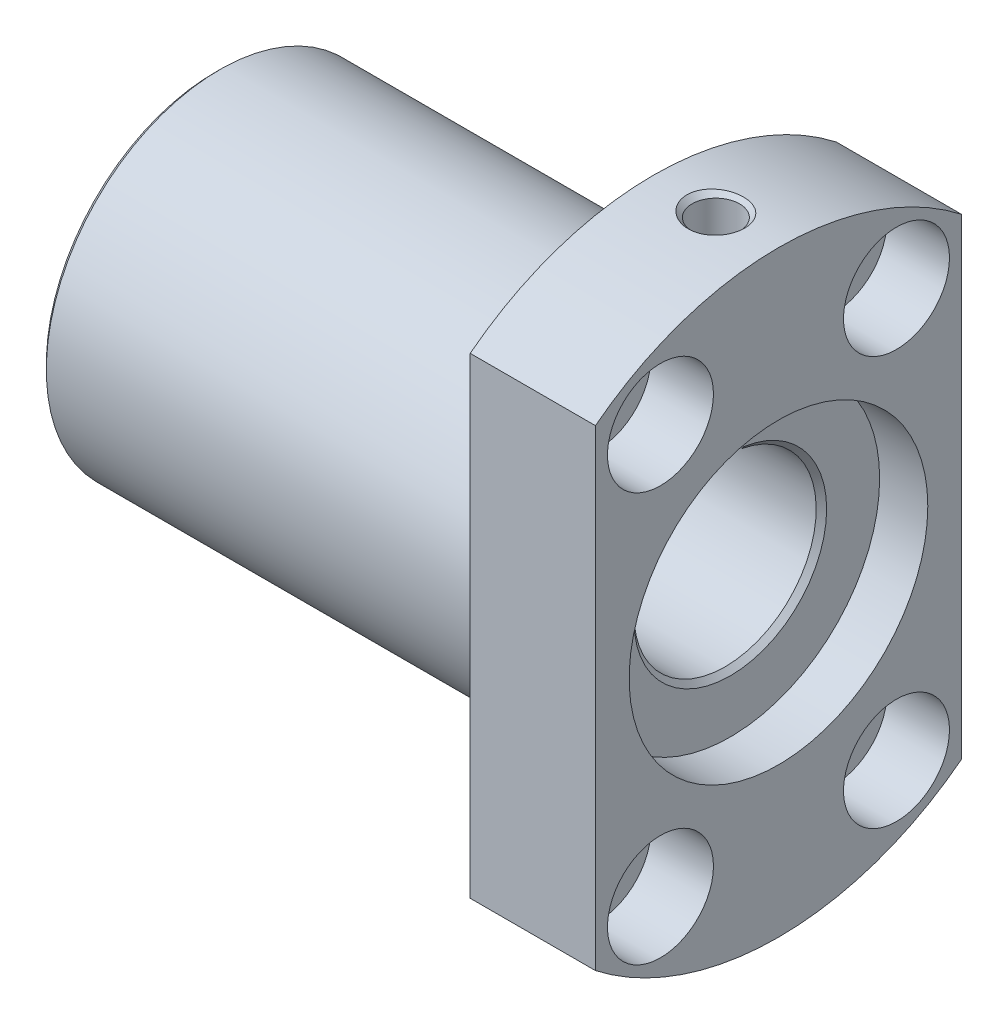
ISO-10303-21;
HEADER;
FILE_DESCRIPTION(('STEP AP214'),'2;1');
FILE_NAME('part.step','',(''),(''),'','','');
FILE_SCHEMA(('AUTOMOTIVE_DESIGN { 1 0 10303 214 1 1 1 1 }'));
ENDSEC;
DATA;
#1=APPLICATION_CONTEXT('core data for automotive mechanical design processes');
#2=APPLICATION_PROTOCOL_DEFINITION('international standard','automotive_design',2000,#1);
#3=PRODUCT_CONTEXT('',#1,'mechanical');
#4=PRODUCT('Part','Part','',(#3));
#5=PRODUCT_RELATED_PRODUCT_CATEGORY('part','',(#4));
#6=PRODUCT_DEFINITION_FORMATION('','',#4);
#7=PRODUCT_DEFINITION_CONTEXT('part definition',#1,'design');
#8=PRODUCT_DEFINITION('design','',#6,#7);
#9=PRODUCT_DEFINITION_SHAPE('','',#8);
#10=(LENGTH_UNIT() NAMED_UNIT(*) SI_UNIT(.MILLI.,.METRE.));
#11=(NAMED_UNIT(*) PLANE_ANGLE_UNIT() SI_UNIT($,.RADIAN.));
#12=(NAMED_UNIT(*) SI_UNIT($,.STERADIAN.) SOLID_ANGLE_UNIT());
#13=UNCERTAINTY_MEASURE_WITH_UNIT(LENGTH_MEASURE(1.E-05),#10,'distance_accuracy_value','');
#14=(GEOMETRIC_REPRESENTATION_CONTEXT(3) GLOBAL_UNCERTAINTY_ASSIGNED_CONTEXT((#13)) GLOBAL_UNIT_ASSIGNED_CONTEXT((#10,
#11,#12)) REPRESENTATION_CONTEXT('',''));
#15=CARTESIAN_POINT('',(0.,0.,0.));
#16=DIRECTION('',(0.,0.,1.));
#17=DIRECTION('',(1.,0.,0.));
#18=AXIS2_PLACEMENT_3D('',#15,#16,#17);
#19=CARTESIAN_POINT('',(827.75,0.,0.));
#20=DIRECTION('',(1.,0.,0.));
#21=DIRECTION('',(0.,0.,-1.));
#22=AXIS2_PLACEMENT_3D('',#19,#20,#21);
#23=CONICAL_SURFACE('',#22,9.99999999999999,0.785398163397458);
#24=CARTESIAN_POINT('',(827.75,0.,0.));
#25=DIRECTION('',(1.,0.,0.));
#26=DIRECTION('',(0.,0.,-1.));
#27=AXIS2_PLACEMENT_3D('',#24,#25,#26);
#28=CIRCLE('',#27,10.);
#29=CARTESIAN_POINT('',(827.75,9.9121138007995,1.32287565553231));
#30=VERTEX_POINT('',#29);
#31=CARTESIAN_POINT('',(827.75,9.9121138007995,-1.32287565553233));
#32=VERTEX_POINT('',#31);
#33=EDGE_CURVE('E83',#30,#32,#28,.T.);
#34=ORIENTED_EDGE('',*,*,#33,.T.);
#35=CARTESIAN_POINT('',(827.75,9.91211380079951,-1.32287565553234));
#36=CARTESIAN_POINT('',(827.709124962366,9.86468983407072,-1.36919680959697));
#37=CARTESIAN_POINT('',(827.666890498792,9.81585567181097,-1.41278724147606));
#38=CARTESIAN_POINT('',(827.580338384388,9.71617737689539,-1.49457124787764));
#39=CARTESIAN_POINT('',(827.536032508283,9.66534481709641,-1.53279131486725));
#40=CARTESIAN_POINT('',(827.445555766791,9.56199410662673,-1.60436020141633));
#41=CARTESIAN_POINT('',(827.399385300994,9.5094763175985,-1.63771005768593));
#42=CARTESIAN_POINT('',(827.305204528102,9.40286057552503,-1.69992138470777));
#43=CARTESIAN_POINT('',(827.25718597894,9.34875588405938,-1.72875888606244));
#44=CARTESIAN_POINT('',(827.208499999957,9.29418874884218,-1.75535687257106));
#45=B_SPLINE_CURVE_WITH_KNOTS('',3,(#35,#36,#37,#38,#39,#40,#41,#42,#43,#44),.UNSPECIFIED.,.F.,
.F.,(4,2,2,2,4),(0.,0.233495743528674,0.46579583534785,0.698046405694527,0.931491609557884),.UNSPECIFIED.);
#46=CARTESIAN_POINT('',(827.208499999952,9.29418874886478,-1.75535687257395));
#47=VERTEX_POINT('',#46);
#48=EDGE_CURVE('E21',#32,#47,#45,.T.);
#49=ORIENTED_EDGE('',*,*,#48,.T.);
#50=CARTESIAN_POINT('',(827.2085,0.,0.));
#51=DIRECTION('',(1.,0.,0.));
#52=DIRECTION('',(0.,0.,-1.));
#53=AXIS2_PLACEMENT_3D('',#50,#51,#52);
#54=CIRCLE('',#53,9.4585);
#55=CARTESIAN_POINT('',(827.2085,9.29418874889036,1.75535687254759));
#56=VERTEX_POINT('',#55);
#57=EDGE_CURVE('E81',#47,#56,#54,.F.);
#58=ORIENTED_EDGE('',*,*,#57,.T.);
#59=CARTESIAN_POINT('',(827.2085,9.29418874889036,1.75535687254759));
#60=CARTESIAN_POINT('',(827.257185978979,9.34875588410325,1.72875888603959));
#61=CARTESIAN_POINT('',(827.305204528137,9.40286057556457,1.69992138468589));
#62=CARTESIAN_POINT('',(827.399385301021,9.50947631762956,1.63771005766661));
#63=CARTESIAN_POINT('',(827.445555766815,9.56199410665364,1.60436020139859));
#64=CARTESIAN_POINT('',(827.5360325083,9.66534481711521,1.53279131485334));
#65=CARTESIAN_POINT('',(827.580338384401,9.71617737691023,1.49457124786597));
#66=CARTESIAN_POINT('',(827.666890498798,9.81585567181816,1.41278724146965));
#67=CARTESIAN_POINT('',(827.709124962369,9.86468983407423,1.36919680959355));
#68=CARTESIAN_POINT('',(827.75,9.9121138007995,1.32287565553236));
#69=B_SPLINE_CURVE_WITH_KNOTS('',3,(#59,#60,#61,#62,#63,#64,#65,#66,#67,#68),.UNSPECIFIED.,.F.,
.F.,(4,2,2,2,4),(0.,0.233445203845981,0.465695774175681,0.697995865977701,0.931491609489217),.UNSPECIFIED.);
#70=EDGE_CURVE('E87',#56,#30,#69,.T.);
#71=ORIENTED_EDGE('',*,*,#70,.T.);
#72=EDGE_LOOP('',(#34,#49,#58,#71));
#73=FACE_BOUND('',#72,.T.);
#74=ADVANCED_FACE('F17',(#73),#23,.F.);
#75=CARTESIAN_POINT('',(826.25,14.8676424507883,0.));
#76=DIRECTION('',(0.,-1.,0.));
#77=DIRECTION('',(0.,0.,-1.));
#78=AXIS2_PLACEMENT_3D('',#75,#76,#77);
#79=CYLINDRICAL_SURFACE('',#78,2.);
#80=ORIENTED_EDGE('',*,*,#70,.F.);
#81=CARTESIAN_POINT('',(827.2085,9.29418874889035,1.75535687254759));
#82=CARTESIAN_POINT('',(827.159992328888,9.28918498913295,1.78184326444738));
#83=CARTESIAN_POINT('',(827.110387287465,9.28444678824169,1.80631868300601));
#84=CARTESIAN_POINT('',(827.009270593768,9.27562273369679,1.85109957967904));
#85=CARTESIAN_POINT('',(826.957758833406,9.27153691709546,1.87140482096599));
#86=CARTESIAN_POINT('',(826.800939625697,9.26045030079549,1.92579211084513));
#87=CARTESIAN_POINT('',(826.693221163041,9.25460675432746,1.95341505251219));
#88=CARTESIAN_POINT('',(826.474500956478,9.24671054458624,1.99045959220235));
#89=CARTESIAN_POINT('',(826.363496064051,9.24466164452858,1.9998631221502));
#90=CARTESIAN_POINT('',(826.141495859705,9.24460318427891,2.0001337640354));
#91=CARTESIAN_POINT('',(826.030500564468,9.24659187455734,1.99100890451493));
#92=CARTESIAN_POINT('',(825.812666064328,9.25433562553321,1.95469392268662));
#93=CARTESIAN_POINT('',(825.7057987918,9.26005723337002,1.92766422350042));
#94=CARTESIAN_POINT('',(825.498101953221,9.27457959260886,1.85653010598874));
#95=CARTESIAN_POINT('',(825.39727433481,9.28338133108407,1.81242021358079));
#96=CARTESIAN_POINT('',(825.203218030092,9.30320029837076,1.70778893418694));
#97=CARTESIAN_POINT('',(825.110093176783,9.31424246983495,1.64707983881338));
#98=CARTESIAN_POINT('',(824.935240192546,9.33725283979065,1.5111810326327));
#99=CARTESIAN_POINT('',(824.853511317657,9.34922097775318,1.4359922678613));
#100=CARTESIAN_POINT('',(824.70216841002,9.37300935176981,1.27158642459021));
#101=CARTESIAN_POINT('',(824.632809126093,9.3848226517714,1.1821335892906));
#102=CARTESIAN_POINT('',(824.510036207782,9.40675462200363,0.992610659088456));
#103=CARTESIAN_POINT('',(824.456631487829,9.41687234346834,0.892534670783486));
#104=CARTESIAN_POINT('',(824.367504491443,9.4342513714551,0.68481237828306));
#105=CARTESIAN_POINT('',(824.331747387876,9.44151829808578,0.57718146717131));
#106=CARTESIAN_POINT('',(824.278975003244,9.45237937903712,0.357441412538));
#107=CARTESIAN_POINT('',(824.261911118465,9.4559830563006,0.245344671692147));
#108=CARTESIAN_POINT('',(824.25146663784,9.45819059484981,0.0885584695671524));
#109=CARTESIAN_POINT('',(824.249995863978,9.45850190858689,0.0442917313056402));
#110=CARTESIAN_POINT('',(824.250010352046,9.45849522299902,-0.110857747675023));
#111=CARTESIAN_POINT('',(824.259260285027,9.4565282630573,-0.221872064410015));
#112=CARTESIAN_POINT('',(824.296028759364,9.44885810202458,-0.440891612091419));
#113=CARTESIAN_POINT('',(824.323592387904,9.44314568029659,-0.548888729373908));
#114=CARTESIAN_POINT('',(824.396089489968,9.42862408527731,-0.758473102897842));
#115=CARTESIAN_POINT('',(824.440993997704,9.41982007830753,-0.86007072127953));
#116=CARTESIAN_POINT('',(824.546824544483,9.40007119614985,-1.05423892035544));
#117=CARTESIAN_POINT('',(824.607743389705,9.38912728279619,-1.14681352875668));
#118=CARTESIAN_POINT('',(824.744864064003,9.36611114052238,-1.32177359433504));
#119=CARTESIAN_POINT('',(824.821263129582,9.35402555075587,-1.40400274483709));
#120=CARTESIAN_POINT('',(824.986758619184,9.33018264540994,-1.55458696914434));
#121=CARTESIAN_POINT('',(825.075857304675,9.31842538874491,-1.62293956663353));
#122=CARTESIAN_POINT('',(825.265347309249,9.2964419469062,-1.74449324643459));
#123=CARTESIAN_POINT('',(825.365845154586,9.28623271624459,-1.79753160360126));
#124=CARTESIAN_POINT('',(825.574569472832,9.26869103879723,-1.88590340566774));
#125=CARTESIAN_POINT('',(825.682794375086,9.26135800933205,-1.92124043701897));
#126=CARTESIAN_POINT('',(825.902217808406,9.25053246356819,-1.97270358750146));
#127=CARTESIAN_POINT('',(826.013348936435,9.24698489724912,-1.98910536876383));
#128=CARTESIAN_POINT('',(826.236891391325,9.24396610348118,-2.0030895292276));
#129=CARTESIAN_POINT('',(826.349303105243,9.24449614298521,-2.00066605923282));
#130=CARTESIAN_POINT('',(826.570205531367,9.24952650895627,-1.9772750388254));
#131=CARTESIAN_POINT('',(826.678730273588,9.25396221606214,-1.9566092932909));
#132=CARTESIAN_POINT('',(826.890609851949,9.26619915564349,-1.897805293714));
#133=CARTESIAN_POINT('',(826.993973775535,9.27399422146897,-1.85969904664347));
#134=CARTESIAN_POINT('',(827.112815303815,9.28478799566163,-1.80444369409933));
#135=CARTESIAN_POINT('',(827.132191571924,9.28660947189719,-1.79504964931485));
#136=CARTESIAN_POINT('',(827.170599191947,9.29033708913667,-1.77565692882349));
#137=CARTESIAN_POINT('',(827.189630957738,9.29224311753428,-1.76565905123981));
#138=CARTESIAN_POINT('',(827.208499999945,9.29418874888465,-1.75535687257775));
#139=B_SPLINE_CURVE_WITH_KNOTS('',3,(#81,#82,#83,#84,#85,#86,#87,#88,#89,#90,#91,#92,#93,#94,
#95,#96,#97,#98,#99,#100,#101,#102,#103,#104,#105,#106,#107,#108,#109,#110,#111,#112,#113,#114,
#115,#116,#117,#118,#119,#120,#121,#122,#123,#124,#125,#126,#127,#128,#129,#130,#131,#132,#133,
#134,#135,#136,#137,#138),.UNSPECIFIED.,.F.,.F.,(4,2,2,2,2,2,2,2,2,2,2,2,2,2,2,2,2,2,2,2,2,2,2,
2,2,2,2,2,4),(0.,0.166383441527193,0.332776329481697,0.665131371627318,0.997815839803331,
1.33035618313174,1.65995663025326,1.98966279956168,2.32326367638294,2.6568427646306,
2.99665145857508,3.33664966315656,3.67597417963846,4.01441431844714,4.14723907274859,
4.4796860704904,4.81295458000808,5.14566879708279,5.47823380980726,5.81533770803265,
6.15250171076776,6.49312654951266,6.83368234658985,7.16921514830953,7.50485220763734,
7.83503834355972,8.16462093365908,8.2294472225115,8.29418962603755),.UNSPECIFIED.);
#140=EDGE_CURVE('E88',#56,#47,#139,.T.);
#141=ORIENTED_EDGE('',*,*,#140,.T.);
#142=ORIENTED_EDGE('',*,*,#48,.F.);
#143=DIRECTION('',(0.,1.,0.));
#144=VECTOR('',#143,1.);
#145=CARTESIAN_POINT('',(827.75,12.75,-1.3228756555323));
#146=LINE('',#145,#144);
#147=CARTESIAN_POINT('',(827.75,15.4434452114805,-1.32287565553231));
#148=VERTEX_POINT('',#147);
#149=EDGE_CURVE('E266',#32,#148,#146,.T.);
#150=ORIENTED_EDGE('',*,*,#149,.T.);
#151=CARTESIAN_POINT('',(827.75,15.4434452114805,1.32287565553232));
#152=CARTESIAN_POINT('',(827.787065384823,15.4470456020406,1.28084560866982));
#153=CARTESIAN_POINT('',(827.822348500751,15.4506044273659,1.23727676683473));
#154=CARTESIAN_POINT('',(827.889143838584,15.4575447091983,1.14732319011858));
#155=CARTESIAN_POINT('',(827.920655934768,15.4609261597898,1.10093836143343));
#156=CARTESIAN_POINT('',(828.009302617837,15.470671518659,0.957827656498796));
#157=CARTESIAN_POINT('',(828.060445993556,15.4766261626144,0.857260901324683));
#158=CARTESIAN_POINT('',(828.145163044704,15.4867641286148,0.648880430520528));
#159=CARTESIAN_POINT('',(828.178722082729,15.4909459744114,0.541060761446516));
#160=CARTESIAN_POINT('',(828.22716730625,15.4970512512113,0.32151008443251));
#161=CARTESIAN_POINT('',(828.242115869225,15.4989822251587,0.20979343974359));
#162=CARTESIAN_POINT('',(828.249205159615,15.4998978102764,0.0652144291749919));
#163=CARTESIAN_POINT('',(828.250002538829,15.5000007617038,0.0326148293424821));
#164=CARTESIAN_POINT('',(828.249991307074,15.4999973919339,-0.111672849610573));
#165=CARTESIAN_POINT('',(828.240604608948,15.4987788814499,-0.223524245542025));
#166=CARTESIAN_POINT('',(828.203257312783,15.4940274929558,-0.444273174723321));
#167=CARTESIAN_POINT('',(828.175242513109,15.4904878616658,-0.553161120066875));
#168=CARTESIAN_POINT('',(828.101458604483,15.4814909470684,-0.764613015372334));
#169=CARTESIAN_POINT('',(828.055696993122,15.4760344736711,-0.867179614768503));
#170=CARTESIAN_POINT('',(827.947815443916,15.463820071736,-1.06295011742754));
#171=CARTESIAN_POINT('',(827.885737907025,15.4570655286088,-1.15617743615474));
#172=CARTESIAN_POINT('',(827.79497598373,15.4478638717063,-1.27053292251512));
#173=CARTESIAN_POINT('',(827.77281970098,15.4456618376756,-1.29700854591425));
#174=CARTESIAN_POINT('',(827.75,15.4434452114805,-1.32287565553234));
#175=B_SPLINE_CURVE_WITH_KNOTS('',3,(#151,#152,#153,#154,#155,#156,#157,#158,#159,#160,#161,
#162,#163,#164,#165,#166,#167,#168,#169,#170,#171,#172,#173,#174),.UNSPECIFIED.,.F.,.F.,(4,2,2,
2,2,2,2,2,2,2,2,4),(0.,0.168359521237021,0.336724653823295,0.673911258593361,1.01137809721356,
1.34771076252253,1.44553025095052,1.78046320140361,2.1163749858965,2.45214501025787,
2.78705093599518,2.89078042824445),.UNSPECIFIED.);
#176=CARTESIAN_POINT('',(827.75,15.4434452114805,1.3228756555323));
#177=VERTEX_POINT('',#176);
#178=EDGE_CURVE('E93',#177,#148,#175,.T.);
#179=ORIENTED_EDGE('',*,*,#178,.F.);
#180=DIRECTION('',(0.,1.,0.));
#181=VECTOR('',#180,1.);
#182=CARTESIAN_POINT('',(827.75,12.75,1.32287565553228));
#183=LINE('',#182,#181);
#184=EDGE_CURVE('E372',#177,#30,#183,.F.);
#185=ORIENTED_EDGE('',*,*,#184,.T.);
#186=EDGE_LOOP('',(#80,#141,#142,#150,#179,#185));
#187=FACE_BOUND('',#186,.T.);
#188=CARTESIAN_POINT('',(826.25,22.2352849015692,0.));
#189=DIRECTION('',(0.,1.,0.));
#190=DIRECTION('',(1.,0.,0.));
#191=AXIS2_PLACEMENT_3D('',#188,#189,#190);
#192=CIRCLE('',#191,2.00000000002543);
#193=CARTESIAN_POINT('',(828.250000000025,22.2352849015692,0.));
#194=VERTEX_POINT('',#193);
#195=EDGE_CURVE('E96',#194,#194,#192,.T.);
#196=ORIENTED_EDGE('',*,*,#195,.T.);
#197=EDGE_LOOP('',(#196));
#198=FACE_BOUND('',#197,.T.);
#199=ADVANCED_FACE('F89',(#187,#198),#79,.F.);
#200=CARTESIAN_POINT('',(803.5,0.,0.));
#201=DIRECTION('',(1.,0.,0.));
#202=DIRECTION('',(0.,0.,-1.));
#203=AXIS2_PLACEMENT_3D('',#200,#201,#202);
#204=CYLINDRICAL_SURFACE('',#203,9.4585);
#205=CARTESIAN_POINT('',(779.7915,0.,0.));
#206=DIRECTION('',(-1.,0.,0.));
#207=DIRECTION('',(0.,1.,0.));
#208=AXIS2_PLACEMENT_3D('',#205,#206,#207);
#209=CIRCLE('',#208,9.45849999999997);
#210=CARTESIAN_POINT('',(779.7915,9.45849999999997,0.));
#211=VERTEX_POINT('',#210);
#212=EDGE_CURVE('E102',#211,#211,#209,.T.);
#213=ORIENTED_EDGE('',*,*,#212,.T.);
#214=EDGE_LOOP('',(#213));
#215=FACE_BOUND('',#214,.T.);
#216=ORIENTED_EDGE('',*,*,#140,.F.);
#217=ORIENTED_EDGE('',*,*,#57,.F.);
#218=EDGE_LOOP('',(#216,#217));
#219=FACE_BOUND('',#218,.T.);
#220=ADVANCED_FACE('F95',(#215,#219),#204,.F.);
#221=CARTESIAN_POINT('',(826.25,22.4999999999795,0.));
#222=DIRECTION('',(0.,1.,0.));
#223=DIRECTION('',(0.,0.,1.));
#224=AXIS2_PLACEMENT_3D('',#221,#222,#223);
#225=CONICAL_SURFACE('',#224,2.45850000000469,1.04719755119851);
#226=CARTESIAN_POINT('',(826.25,22.5,0.));
#227=DIRECTION('',(0.,-1.,0.));
#228=DIRECTION('',(0.,0.,-1.));
#229=AXIS2_PLACEMENT_3D('',#226,#227,#228);
#230=CIRCLE('',#229,2.4585);
#231=CARTESIAN_POINT('',(826.25,22.5,-2.4585));
#232=VERTEX_POINT('',#231);
#233=EDGE_CURVE('E265',#232,#232,#230,.F.);
#234=ORIENTED_EDGE('',*,*,#233,.T.);
#235=EDGE_LOOP('',(#234));
#236=FACE_BOUND('',#235,.T.);
#237=ORIENTED_EDGE('',*,*,#195,.F.);
#238=EDGE_LOOP('',(#237));
#239=FACE_BOUND('',#238,.T.);
#240=ADVANCED_FACE('F280',(#236,#239),#225,.F.);
#241=CARTESIAN_POINT('',(827.75,12.75,0.));
#242=DIRECTION('',(-1.,0.,0.));
#243=DIRECTION('',(0.,0.,1.));
#244=AXIS2_PLACEMENT_3D('',#241,#242,#243);
#245=PLANE('',#244);
#246=CARTESIAN_POINT('',(827.75,0.,0.));
#247=DIRECTION('',(1.,0.,0.));
#248=DIRECTION('',(0.,0.,-1.));
#249=AXIS2_PLACEMENT_3D('',#246,#247,#248);
#250=CIRCLE('',#249,15.5);
#251=EDGE_CURVE('E262',#177,#148,#250,.T.);
#252=ORIENTED_EDGE('',*,*,#251,.T.);
#253=ORIENTED_EDGE('',*,*,#149,.F.);
#254=ORIENTED_EDGE('',*,*,#33,.F.);
#255=ORIENTED_EDGE('',*,*,#184,.F.);
#256=EDGE_LOOP('',(#252,#253,#254,#255));
#257=FACE_BOUND('',#256,.T.);
#258=ADVANCED_FACE('F284',(#257),#245,.F.);
#259=CARTESIAN_POINT('',(779.25,0.,0.));
#260=DIRECTION('',(-1.,0.,0.));
#261=DIRECTION('',(0.,0.,1.));
#262=AXIS2_PLACEMENT_3D('',#259,#260,#261);
#263=CONICAL_SURFACE('',#262,9.99999999999999,0.785398163397448);
#264=CARTESIAN_POINT('',(779.25,0.,0.));
#265=DIRECTION('',(-1.,0.,0.));
#266=DIRECTION('',(0.,0.,1.));
#267=AXIS2_PLACEMENT_3D('',#264,#265,#266);
#268=CIRCLE('',#267,9.99999999999999);
#269=CARTESIAN_POINT('',(779.25,0.,9.99999999999999));
#270=VERTEX_POINT('',#269);
#271=EDGE_CURVE('E259',#270,#270,#268,.T.);
#272=ORIENTED_EDGE('',*,*,#271,.T.);
#273=EDGE_LOOP('',(#272));
#274=FACE_BOUND('',#273,.T.);
#275=ORIENTED_EDGE('',*,*,#212,.F.);
#276=EDGE_LOOP('',(#275));
#277=FACE_BOUND('',#276,.T.);
#278=ADVANCED_FACE('F288',(#274,#277),#263,.F.);
#279=CARTESIAN_POINT('',(826.25,26.47925,0.));
#280=DIRECTION('',(0.,-1.,0.));
#281=DIRECTION('',(0.,0.,-1.));
#282=AXIS2_PLACEMENT_3D('',#279,#280,#281);
#283=CYLINDRICAL_SURFACE('',#282,2.4585);
#284=CARTESIAN_POINT('',(826.25,30.4585000000657,0.));
#285=DIRECTION('',(0.,1.,0.));
#286=DIRECTION('',(1.,0.,0.));
#287=AXIS2_PLACEMENT_3D('',#284,#285,#286);
#288=CIRCLE('',#287,2.45850000000469);
#289=CARTESIAN_POINT('',(828.708500000005,30.4585000000657,0.));
#290=VERTEX_POINT('',#289);
#291=EDGE_CURVE('E246',#290,#290,#288,.T.);
#292=ORIENTED_EDGE('',*,*,#291,.T.);
#293=EDGE_LOOP('',(#292));
#294=FACE_BOUND('',#293,.T.);
#295=ORIENTED_EDGE('',*,*,#233,.F.);
#296=EDGE_LOOP('',(#295));
#297=FACE_BOUND('',#296,.T.);
#298=ADVANCED_FACE('F292',(#294,#297),#283,.F.);
#299=CARTESIAN_POINT('',(830.25,0.,0.));
#300=DIRECTION('',(1.,0.,0.));
#301=DIRECTION('',(0.,0.,-1.));
#302=AXIS2_PLACEMENT_3D('',#299,#300,#301);
#303=CYLINDRICAL_SURFACE('',#302,15.5);
#304=CARTESIAN_POINT('',(832.75,0.,0.));
#305=DIRECTION('',(1.,0.,0.));
#306=DIRECTION('',(0.,0.,-1.));
#307=AXIS2_PLACEMENT_3D('',#304,#305,#306);
#308=CIRCLE('',#307,15.5);
#309=CARTESIAN_POINT('',(832.75,0.,-15.5));
#310=VERTEX_POINT('',#309);
#311=EDGE_CURVE('E243',#310,#310,#308,.F.);
#312=ORIENTED_EDGE('',*,*,#311,.F.);
#313=EDGE_LOOP('',(#312));
#314=FACE_BOUND('',#313,.T.);
#315=ORIENTED_EDGE('',*,*,#178,.T.);
#316=ORIENTED_EDGE('',*,*,#251,.F.);
#317=EDGE_LOOP('',(#315,#316));
#318=FACE_BOUND('',#317,.T.);
#319=ADVANCED_FACE('F295',(#314,#318),#303,.F.);
#320=CARTESIAN_POINT('',(829.5,21.2176223927187,-12.25));
#321=DIRECTION('',(1.,0.,0.));
#322=DIRECTION('',(0.,0.,-1.));
#323=AXIS2_PLACEMENT_3D('',#320,#321,#322);
#324=CYLINDRICAL_SURFACE('',#323,5.5);
#325=CARTESIAN_POINT('',(832.75,21.2176223927187,-12.25));
#326=DIRECTION('',(1.,0.,0.));
#327=DIRECTION('',(0.,0.,-1.));
#328=AXIS2_PLACEMENT_3D('',#325,#326,#327);
#329=CIRCLE('',#328,5.5);
#330=CARTESIAN_POINT('',(832.75,21.2176223927187,-17.75));
#331=VERTEX_POINT('',#330);
#332=EDGE_CURVE('E240',#331,#331,#329,.F.);
#333=ORIENTED_EDGE('',*,*,#332,.F.);
#334=EDGE_LOOP('',(#333));
#335=FACE_BOUND('',#334,.T.);
#336=CARTESIAN_POINT('',(826.25,21.2176223927187,-12.25));
#337=DIRECTION('',(1.,0.,0.));
#338=DIRECTION('',(0.,0.,-1.));
#339=AXIS2_PLACEMENT_3D('',#336,#337,#338);
#340=CIRCLE('',#339,5.5);
#341=CARTESIAN_POINT('',(826.25,21.2176223927187,-17.75));
#342=VERTEX_POINT('',#341);
#343=EDGE_CURVE('E256',#342,#342,#340,.F.);
#344=ORIENTED_EDGE('',*,*,#343,.T.);
#345=EDGE_LOOP('',(#344));
#346=FACE_BOUND('',#345,.T.);
#347=ADVANCED_FACE('F300',(#335,#346),#324,.F.);
#348=CARTESIAN_POINT('',(829.5,-21.2176223927187,12.25));
#349=DIRECTION('',(1.,0.,0.));
#350=DIRECTION('',(0.,0.,-1.));
#351=AXIS2_PLACEMENT_3D('',#348,#349,#350);
#352=CYLINDRICAL_SURFACE('',#351,5.5);
#353=CARTESIAN_POINT('',(832.75,-21.2176223927187,12.25));
#354=DIRECTION('',(1.,0.,0.));
#355=DIRECTION('',(0.,0.,-1.));
#356=AXIS2_PLACEMENT_3D('',#353,#354,#355);
#357=CIRCLE('',#356,5.5);
#358=CARTESIAN_POINT('',(832.75,-21.2176223927187,6.75));
#359=VERTEX_POINT('',#358);
#360=EDGE_CURVE('E237',#359,#359,#357,.F.);
#361=ORIENTED_EDGE('',*,*,#360,.F.);
#362=EDGE_LOOP('',(#361));
#363=FACE_BOUND('',#362,.T.);
#364=CARTESIAN_POINT('',(826.25,-21.2176223927187,12.25));
#365=DIRECTION('',(1.,0.,0.));
#366=DIRECTION('',(0.,0.,-1.));
#367=AXIS2_PLACEMENT_3D('',#364,#365,#366);
#368=CIRCLE('',#367,5.5);
#369=CARTESIAN_POINT('',(826.25,-21.2176223927187,6.75));
#370=VERTEX_POINT('',#369);
#371=EDGE_CURVE('E253',#370,#370,#368,.F.);
#372=ORIENTED_EDGE('',*,*,#371,.T.);
#373=EDGE_LOOP('',(#372));
#374=FACE_BOUND('',#373,.T.);
#375=ADVANCED_FACE('F304',(#363,#374),#352,.F.);
#376=CARTESIAN_POINT('',(829.5,-21.2176223927187,-12.25));
#377=DIRECTION('',(1.,0.,0.));
#378=DIRECTION('',(0.,0.,-1.));
#379=AXIS2_PLACEMENT_3D('',#376,#377,#378);
#380=CYLINDRICAL_SURFACE('',#379,5.5);
#381=CARTESIAN_POINT('',(832.75,-21.2176223927187,-12.25));
#382=DIRECTION('',(1.,0.,0.));
#383=DIRECTION('',(0.,0.,-1.));
#384=AXIS2_PLACEMENT_3D('',#381,#382,#383);
#385=CIRCLE('',#384,5.5);
#386=CARTESIAN_POINT('',(832.75,-21.2176223927187,-17.75));
#387=VERTEX_POINT('',#386);
#388=EDGE_CURVE('E231',#387,#387,#385,.F.);
#389=ORIENTED_EDGE('',*,*,#388,.F.);
#390=EDGE_LOOP('',(#389));
#391=FACE_BOUND('',#390,.T.);
#392=CARTESIAN_POINT('',(826.25,-21.2176223927187,-12.25));
#393=DIRECTION('',(1.,0.,0.));
#394=DIRECTION('',(0.,0.,-1.));
#395=AXIS2_PLACEMENT_3D('',#392,#393,#394);
#396=CIRCLE('',#395,5.5);
#397=CARTESIAN_POINT('',(826.25,-21.2176223927187,-17.75));
#398=VERTEX_POINT('',#397);
#399=EDGE_CURVE('E250',#398,#398,#396,.F.);
#400=ORIENTED_EDGE('',*,*,#399,.T.);
#401=EDGE_LOOP('',(#400));
#402=FACE_BOUND('',#401,.T.);
#403=ADVANCED_FACE('F308',(#391,#402),#380,.F.);
#404=CARTESIAN_POINT('',(829.5,21.2176223927187,12.25));
#405=DIRECTION('',(1.,0.,0.));
#406=DIRECTION('',(0.,0.,-1.));
#407=AXIS2_PLACEMENT_3D('',#404,#405,#406);
#408=CYLINDRICAL_SURFACE('',#407,5.5);
#409=CARTESIAN_POINT('',(832.75,21.2176223927187,12.25));
#410=DIRECTION('',(1.,0.,0.));
#411=DIRECTION('',(0.,0.,-1.));
#412=AXIS2_PLACEMENT_3D('',#409,#410,#411);
#413=CIRCLE('',#412,5.5);
#414=CARTESIAN_POINT('',(832.75,21.2176223927187,6.75));
#415=VERTEX_POINT('',#414);
#416=EDGE_CURVE('E225',#415,#415,#413,.F.);
#417=ORIENTED_EDGE('',*,*,#416,.F.);
#418=EDGE_LOOP('',(#417));
#419=FACE_BOUND('',#418,.T.);
#420=CARTESIAN_POINT('',(826.25,21.2176223927187,12.25));
#421=DIRECTION('',(1.,0.,0.));
#422=DIRECTION('',(0.,0.,-1.));
#423=AXIS2_PLACEMENT_3D('',#420,#421,#422);
#424=CIRCLE('',#423,5.5);
#425=CARTESIAN_POINT('',(826.25,21.2176223927187,6.75));
#426=VERTEX_POINT('',#425);
#427=EDGE_CURVE('E247',#426,#426,#424,.F.);
#428=ORIENTED_EDGE('',*,*,#427,.T.);
#429=EDGE_LOOP('',(#428));
#430=FACE_BOUND('',#429,.T.);
#431=ADVANCED_FACE('F312',(#419,#430),#408,.F.);
#432=CARTESIAN_POINT('',(779.25,12.75,0.));
#433=DIRECTION('',(1.,0.,0.));
#434=DIRECTION('',(0.,0.,-1.));
#435=AXIS2_PLACEMENT_3D('',#432,#433,#434);
#436=PLANE('',#435);
#437=ORIENTED_EDGE('',*,*,#271,.F.);
#438=EDGE_LOOP('',(#437));
#439=FACE_BOUND('',#438,.T.);
#440=CARTESIAN_POINT('',(779.25,0.,0.));
#441=DIRECTION('',(1.,0.,0.));
#442=DIRECTION('',(0.,0.,-1.));
#443=AXIS2_PLACEMENT_3D('',#440,#441,#442);
#444=CIRCLE('',#443,15.5);
#445=CARTESIAN_POINT('',(779.25,0.,-15.5));
#446=VERTEX_POINT('',#445);
#447=EDGE_CURVE('E222',#446,#446,#444,.F.);
#448=ORIENTED_EDGE('',*,*,#447,.T.);
#449=EDGE_LOOP('',(#448));
#450=FACE_BOUND('',#449,.T.);
#451=ADVANCED_FACE('F316',(#439,#450),#436,.F.);
#452=CARTESIAN_POINT('',(826.25,25.0281341693703,-14.45));
#453=DIRECTION('',(-1.,0.,0.));
#454=DIRECTION('',(0.,0.,1.));
#455=AXIS2_PLACEMENT_3D('',#452,#453,#454);
#456=PLANE('',#455);
#457=ORIENTED_EDGE('',*,*,#343,.F.);
#458=EDGE_LOOP('',(#457));
#459=FACE_BOUND('',#458,.T.);
#460=CARTESIAN_POINT('',(826.25,21.2176223927187,-12.25));
#461=DIRECTION('',(1.,0.,0.));
#462=DIRECTION('',(0.,0.,-1.));
#463=AXIS2_PLACEMENT_3D('',#460,#461,#462);
#464=CIRCLE('',#463,3.3);
#465=CARTESIAN_POINT('',(826.25,21.2176223927187,-15.55));
#466=VERTEX_POINT('',#465);
#467=EDGE_CURVE('E224',#466,#466,#464,.F.);
#468=ORIENTED_EDGE('',*,*,#467,.T.);
#469=EDGE_LOOP('',(#468));
#470=FACE_BOUND('',#469,.T.);
#471=ADVANCED_FACE('F320',(#459,#470),#456,.F.);
#472=CARTESIAN_POINT('',(826.25,-17.4071106160672,10.05));
#473=DIRECTION('',(-1.,0.,0.));
#474=DIRECTION('',(0.,0.,1.));
#475=AXIS2_PLACEMENT_3D('',#472,#473,#474);
#476=PLANE('',#475);
#477=ORIENTED_EDGE('',*,*,#371,.F.);
#478=EDGE_LOOP('',(#477));
#479=FACE_BOUND('',#478,.T.);
#480=CARTESIAN_POINT('',(826.25,-21.2176223927187,12.25));
#481=DIRECTION('',(1.,0.,0.));
#482=DIRECTION('',(0.,0.,-1.));
#483=AXIS2_PLACEMENT_3D('',#480,#481,#482);
#484=CIRCLE('',#483,3.3);
#485=CARTESIAN_POINT('',(826.25,-21.2176223927187,8.95));
#486=VERTEX_POINT('',#485);
#487=EDGE_CURVE('E228',#486,#486,#484,.F.);
#488=ORIENTED_EDGE('',*,*,#487,.T.);
#489=EDGE_LOOP('',(#488));
#490=FACE_BOUND('',#489,.T.);
#491=ADVANCED_FACE('F324',(#479,#490),#476,.F.);
#492=CARTESIAN_POINT('',(826.25,-17.4071106160672,-10.05));
#493=DIRECTION('',(-1.,0.,0.));
#494=DIRECTION('',(0.,0.,1.));
#495=AXIS2_PLACEMENT_3D('',#492,#493,#494);
#496=PLANE('',#495);
#497=ORIENTED_EDGE('',*,*,#399,.F.);
#498=EDGE_LOOP('',(#497));
#499=FACE_BOUND('',#498,.T.);
#500=CARTESIAN_POINT('',(826.25,-21.2176223927187,-12.25));
#501=DIRECTION('',(1.,0.,0.));
#502=DIRECTION('',(0.,0.,-1.));
#503=AXIS2_PLACEMENT_3D('',#500,#501,#502);
#504=CIRCLE('',#503,3.3);
#505=CARTESIAN_POINT('',(826.25,-21.2176223927187,-15.55));
#506=VERTEX_POINT('',#505);
#507=EDGE_CURVE('E341',#506,#506,#504,.F.);
#508=ORIENTED_EDGE('',*,*,#507,.T.);
#509=EDGE_LOOP('',(#508));
#510=FACE_BOUND('',#509,.T.);
#511=ADVANCED_FACE('F328',(#499,#510),#496,.F.);
#512=CARTESIAN_POINT('',(826.25,25.0281341693703,14.45));
#513=DIRECTION('',(-1.,0.,0.));
#514=DIRECTION('',(0.,0.,1.));
#515=AXIS2_PLACEMENT_3D('',#512,#513,#514);
#516=PLANE('',#515);
#517=ORIENTED_EDGE('',*,*,#427,.F.);
#518=EDGE_LOOP('',(#517));
#519=FACE_BOUND('',#518,.T.);
#520=CARTESIAN_POINT('',(826.25,21.2176223927187,12.25));
#521=DIRECTION('',(1.,0.,0.));
#522=DIRECTION('',(0.,0.,-1.));
#523=AXIS2_PLACEMENT_3D('',#520,#521,#522);
#524=CIRCLE('',#523,3.3);
#525=CARTESIAN_POINT('',(826.25,21.2176223927187,8.95));
#526=VERTEX_POINT('',#525);
#527=EDGE_CURVE('E340',#526,#526,#524,.F.);
#528=ORIENTED_EDGE('',*,*,#527,.T.);
#529=EDGE_LOOP('',(#528));
#530=FACE_BOUND('',#529,.T.);
#531=ADVANCED_FACE('F191',(#519,#530),#516,.F.);
#532=CARTESIAN_POINT('',(826.25,31.0032490000367,0.));
#533=DIRECTION('',(0.,1.,0.));
#534=DIRECTION('',(0.,0.,1.));
#535=AXIS2_PLACEMENT_3D('',#532,#533,#534);
#536=CONICAL_SURFACE('',#535,3.00324900003257,0.785398163449622);
#537=CARTESIAN_POINT('',(823.250000000004,31.,0.));
#538=CARTESIAN_POINT('',(823.250007016528,30.9999986046281,-0.148851744321218));
#539=CARTESIAN_POINT('',(823.262205188151,30.9989163926274,-0.297875411730645));
#540=CARTESIAN_POINT('',(823.310629333606,30.9946954389138,-0.592120318803428));
#541=CARTESIAN_POINT('',(823.346901147725,30.9915527738888,-0.7373337536925));
#542=CARTESIAN_POINT('',(823.443785078894,30.9834105235462,-1.02446743254416));
#543=CARTESIAN_POINT('',(823.505126282674,30.9783556870659,-1.16614077837853));
#544=CARTESIAN_POINT('',(823.649996134772,30.9669511782636,-1.437502312621));
#545=CARTESIAN_POINT('',(823.733520364283,30.960601763877,-1.5671928810439));
#546=CARTESIAN_POINT('',(823.922945613369,30.9470656262856,-1.81522235793821));
#547=CARTESIAN_POINT('',(824.029441073432,30.9398595427771,-1.93310585658816));
#548=CARTESIAN_POINT('',(824.259977505117,30.9255283623932,-2.1502480808483));
#549=CARTESIAN_POINT('',(824.384022994417,30.9184032868825,-2.24950199552929));
#550=CARTESIAN_POINT('',(824.65204879148,30.9046566569126,-2.43123268630467));
#551=CARTESIAN_POINT('',(824.796670513826,30.8980716129747,-2.5127664581471));
#552=CARTESIAN_POINT('',(825.097219234693,30.8864796690563,-2.65145883669071));
#553=CARTESIAN_POINT('',(825.253148351396,30.8814730657047,-2.7086128625328));
#554=CARTESIAN_POINT('',(825.578175946094,30.8734113601865,-2.79904127252672));
#555=CARTESIAN_POINT('',(825.747549129102,30.8704366858246,-2.83133730416118));
#556=CARTESIAN_POINT('',(826.089329935543,30.8670775186949,-2.86772752035258));
#557=CARTESIAN_POINT('',(826.261737945984,30.8666933587106,-2.87181808157106));
#558=CARTESIAN_POINT('',(826.608087326142,30.8685757297118,-2.8515158039539));
#559=CARTESIAN_POINT('',(826.781997638404,30.870891659117,-2.82659215988999));
#560=CARTESIAN_POINT('',(827.123140322745,30.8779928610207,-2.74792670148713));
#561=CARTESIAN_POINT('',(827.290372386216,30.8827782474931,-2.69418355702439));
#562=CARTESIAN_POINT('',(827.61272913637,30.8942472048217,-2.55930351800747));
#563=CARTESIAN_POINT('',(827.767890408068,30.9009247303951,-2.4782537133628));
#564=CARTESIAN_POINT('',(828.061879989614,30.9153980365448,-2.29062871663837));
#565=CARTESIAN_POINT('',(828.200711161804,30.9231936206145,-2.18405800783773));
#566=CARTESIAN_POINT('',(828.454078972548,30.9387486754852,-1.95116949241871));
#567=CARTESIAN_POINT('',(828.569153470154,30.9465038143124,-1.82543722775157));
#568=CARTESIAN_POINT('',(828.775450809605,30.961240069748,-1.55557551477925));
#569=CARTESIAN_POINT('',(828.866669568156,30.9682210537296,-1.41144292323658));
#570=CARTESIAN_POINT('',(829.018364767704,30.9802589265528,-1.11558495318663));
#571=CARTESIAN_POINT('',(829.079994012551,30.9853856174963,-0.964452170919554));
#572=CARTESIAN_POINT('',(829.175695851703,30.993489923517,-0.653876392113073));
#573=CARTESIAN_POINT('',(829.209833293327,30.9964725940852,-0.494453901351444));
#574=CARTESIAN_POINT('',(829.236395898688,30.9988019880859,-0.278165119175886));
#575=CARTESIAN_POINT('',(829.241492751507,30.9992502526127,-0.222661579803248));
#576=CARTESIAN_POINT('',(829.24829602867,30.9998495121707,-0.111446721064746));
#577=CARTESIAN_POINT('',(829.250002627233,31.0000005224771,-0.0557354125231636));
#578=CARTESIAN_POINT('',(829.249992983472,30.9999986046281,0.148851744321219));
#579=CARTESIAN_POINT('',(829.237794811849,30.9989163926274,0.297875411730645));
#580=CARTESIAN_POINT('',(829.189370666394,30.9946954389138,0.592120318803428));
#581=CARTESIAN_POINT('',(829.153098852275,30.9915527738888,0.7373337536925));
#582=CARTESIAN_POINT('',(829.056214921106,30.9834105235462,1.02446743254416));
#583=CARTESIAN_POINT('',(828.994873717326,30.9783556870659,1.16614077837853));
#584=CARTESIAN_POINT('',(828.850003865228,30.9669511782636,1.437502312621));
#585=CARTESIAN_POINT('',(828.766479635717,30.960601763877,1.5671928810439));
#586=CARTESIAN_POINT('',(828.577054386631,30.9470656262856,1.81522235793821));
#587=CARTESIAN_POINT('',(828.470558926568,30.9398595427771,1.93310585658816));
#588=CARTESIAN_POINT('',(828.240022494883,30.9255283623932,2.15024808084831));
#589=CARTESIAN_POINT('',(828.115977005583,30.9184032868825,2.24950199552929));
#590=CARTESIAN_POINT('',(827.84795120852,30.9046566569126,2.43123268630467));
#591=CARTESIAN_POINT('',(827.703329486174,30.8980716129747,2.5127664581471));
#592=CARTESIAN_POINT('',(827.402780765307,30.8864796690564,2.65145883669071));
#593=CARTESIAN_POINT('',(827.246851648604,30.8814730657047,2.7086128625328));
#594=CARTESIAN_POINT('',(826.921824053906,30.8734113601865,2.79904127252672));
#595=CARTESIAN_POINT('',(826.752450870898,30.8704366858246,2.83133730416118));
#596=CARTESIAN_POINT('',(826.410670064457,30.8670775186949,2.86772752035258));
#597=CARTESIAN_POINT('',(826.238262054016,30.8666933587106,2.87181808157106));
#598=CARTESIAN_POINT('',(825.891912673858,30.8685757297118,2.85151580395391));
#599=CARTESIAN_POINT('',(825.718002361597,30.870891659117,2.82659215989002));
#600=CARTESIAN_POINT('',(825.376859677256,30.8779928610207,2.74792670148718));
#601=CARTESIAN_POINT('',(825.209627613784,30.8827782474931,2.69418355702442));
#602=CARTESIAN_POINT('',(824.88727086363,30.8942472048217,2.55930351800747));
#603=CARTESIAN_POINT('',(824.732109591932,30.9009247303951,2.4782537133628));
#604=CARTESIAN_POINT('',(824.438120010386,30.9153980365448,2.29062871663837));
#605=CARTESIAN_POINT('',(824.299288838196,30.9231936206145,2.18405800783773));
#606=CARTESIAN_POINT('',(824.045921027452,30.9387486754852,1.95116949241871));
#607=CARTESIAN_POINT('',(823.930846529846,30.9465038143124,1.82543722775157));
#608=CARTESIAN_POINT('',(823.724549190395,30.961240069748,1.55557551477926));
#609=CARTESIAN_POINT('',(823.633330431844,30.9682210537296,1.41144292323658));
#610=CARTESIAN_POINT('',(823.481635232296,30.9802589265528,1.11558495318663));
#611=CARTESIAN_POINT('',(823.420005987449,30.9853856174963,0.964452170919556));
#612=CARTESIAN_POINT('',(823.324304148297,30.993489923517,0.653876392113077));
#613=CARTESIAN_POINT('',(823.290166706673,30.9964725940852,0.494453901351449));
#614=CARTESIAN_POINT('',(823.263604101312,30.9988019880859,0.278165119175892));
#615=CARTESIAN_POINT('',(823.258507248493,30.9992502526127,0.222661579803253));
#616=CARTESIAN_POINT('',(823.25170397133,30.9998495121707,0.111446721064749));
#617=CARTESIAN_POINT('',(823.249997372767,31.0000005224771,0.0557354125231661));
#618=CARTESIAN_POINT('',(823.250000000004,31.,0.));
#619=B_SPLINE_CURVE_WITH_KNOTS('',3,(#537,#538,#539,#540,#541,#542,#543,#544,#545,#546,#547,
#548,#549,#550,#551,#552,#553,#554,#555,#556,#557,#558,#559,#560,#561,#562,#563,#564,#565,#566,
#567,#568,#569,#570,#571,#572,#573,#574,#575,#576,#577,#578,#579,#580,#581,#582,#583,#584,#585,
#586,#587,#588,#589,#590,#591,#592,#593,#594,#595,#596,#597,#598,#599,#600,#601,#602,#603,#604,
#605,#606,#607,#608,#609,#610,#611,#612,#613,#614,#615,#616,#617,#618),.UNSPECIFIED.,.T.,.F.,(4,
2,2,2,2,2,2,2,2,2,2,2,2,2,2,2,2,2,2,2,2,2,2,2,2,2,2,2,2,2,2,2,2,2,2,2,2,2,2,2,4),(0.,
0.446355172656441,0.893562728910618,1.35482403068217,1.8159935190698,2.29095319457921,
2.76603535607639,3.26225633677753,3.75857051443714,4.27354039667198,4.78857643186918,
5.31318492167023,5.83781762612775,6.36079269929461,6.88367596828906,7.39296270898353,
7.9023365653372,8.38981740728922,8.87614498968539,9.04328490675864,9.21041623459965,
9.65677140725609,10.1039789635103,10.5652402652818,11.0264097536694,11.5013694291789,
11.976451590676,12.4726725713772,12.9689867490368,13.4839566312716,13.9989926664688,
14.5236011562696,15.0482338607274,15.5712089338943,16.0940922028887,16.6033789435832,
17.1127527999368,17.6002336418889,18.086561224285,18.2537011413583,18.4208324691993),.UNSPECIFIED.);
#620=CARTESIAN_POINT('',(823.250000000004,31.,0.));
#621=VERTEX_POINT('',#620);
#622=EDGE_CURVE('E136',#621,#621,#619,.T.);
#623=ORIENTED_EDGE('',*,*,#622,.F.);
#624=EDGE_LOOP('',(#623));
#625=FACE_BOUND('',#624,.T.);
#626=ORIENTED_EDGE('',*,*,#291,.F.);
#627=EDGE_LOOP('',(#626));
#628=FACE_BOUND('',#627,.T.);
#629=ADVANCED_FACE('F146',(#625,#628),#536,.F.);
#630=CARTESIAN_POINT('',(832.75,0.,0.));
#631=DIRECTION('',(1.,0.,0.));
#632=DIRECTION('',(0.,0.,-1.));
#633=AXIS2_PLACEMENT_3D('',#630,#631,#632);
#634=PLANE('',#633);
#635=CARTESIAN_POINT('',(832.75,0.,0.));
#636=DIRECTION('',(-1.,0.,0.));
#637=DIRECTION('',(0.,0.,1.));
#638=AXIS2_PLACEMENT_3D('',#635,#636,#637);
#639=CIRCLE('',#638,31.);
#640=CARTESIAN_POINT('',(832.75,-24.4948974278318,-19.));
#641=VERTEX_POINT('',#640);
#642=CARTESIAN_POINT('',(832.75,-24.4948974278318,19.));
#643=VERTEX_POINT('',#642);
#644=EDGE_CURVE('E144',#641,#643,#639,.T.);
#645=ORIENTED_EDGE('',*,*,#644,.F.);
#646=DIRECTION('',(0.,1.,0.));
#647=VECTOR('',#646,1.);
#648=CARTESIAN_POINT('',(832.75,24.4948974278318,-19.));
#649=LINE('',#648,#647);
#650=CARTESIAN_POINT('',(832.75,24.4948974278318,-19.));
#651=VERTEX_POINT('',#650);
#652=EDGE_CURVE('E343',#651,#641,#649,.F.);
#653=ORIENTED_EDGE('',*,*,#652,.F.);
#654=CARTESIAN_POINT('',(832.75,0.,0.));
#655=DIRECTION('',(-1.,0.,0.));
#656=DIRECTION('',(0.,0.,1.));
#657=AXIS2_PLACEMENT_3D('',#654,#655,#656);
#658=CIRCLE('',#657,31.);
#659=CARTESIAN_POINT('',(832.75,24.4948974278318,19.));
#660=VERTEX_POINT('',#659);
#661=EDGE_CURVE('E132',#660,#651,#658,.T.);
#662=ORIENTED_EDGE('',*,*,#661,.F.);
#663=DIRECTION('',(0.,1.,0.));
#664=VECTOR('',#663,1.);
#665=CARTESIAN_POINT('',(832.75,-24.4948974278318,19.));
#666=LINE('',#665,#664);
#667=EDGE_CURVE('E369',#643,#660,#666,.T.);
#668=ORIENTED_EDGE('',*,*,#667,.F.);
#669=EDGE_LOOP('',(#645,#653,#662,#668));
#670=FACE_BOUND('',#669,.T.);
#671=ORIENTED_EDGE('',*,*,#416,.T.);
#672=EDGE_LOOP('',(#671));
#673=FACE_BOUND('',#672,.T.);
#674=ORIENTED_EDGE('',*,*,#388,.T.);
#675=EDGE_LOOP('',(#674));
#676=FACE_BOUND('',#675,.T.);
#677=ORIENTED_EDGE('',*,*,#360,.T.);
#678=EDGE_LOOP('',(#677));
#679=FACE_BOUND('',#678,.T.);
#680=ORIENTED_EDGE('',*,*,#332,.T.);
#681=EDGE_LOOP('',(#680));
#682=FACE_BOUND('',#681,.T.);
#683=ORIENTED_EDGE('',*,*,#311,.T.);
#684=EDGE_LOOP('',(#683));
#685=FACE_BOUND('',#684,.T.);
#686=ADVANCED_FACE('F183',(#670,#673,#676,#679,#682,#685),#634,.T.);
#687=CARTESIAN_POINT('',(776.75,0.,0.));
#688=DIRECTION('',(1.,0.,0.));
#689=DIRECTION('',(0.,0.,-1.));
#690=AXIS2_PLACEMENT_3D('',#687,#688,#689);
#691=CYLINDRICAL_SURFACE('',#690,15.5);
#692=CARTESIAN_POINT('',(774.25,0.,0.));
#693=DIRECTION('',(1.,0.,0.));
#694=DIRECTION('',(0.,0.,-1.));
#695=AXIS2_PLACEMENT_3D('',#692,#693,#694);
#696=CIRCLE('',#695,15.5);
#697=CARTESIAN_POINT('',(774.25,0.,-15.5));
#698=VERTEX_POINT('',#697);
#699=EDGE_CURVE('E128',#698,#698,#696,.T.);
#700=ORIENTED_EDGE('',*,*,#699,.F.);
#701=EDGE_LOOP('',(#700));
#702=FACE_BOUND('',#701,.T.);
#703=ORIENTED_EDGE('',*,*,#447,.F.);
#704=EDGE_LOOP('',(#703));
#705=FACE_BOUND('',#704,.T.);
#706=ADVANCED_FACE('F180',(#702,#705),#691,.F.);
#707=CARTESIAN_POINT('',(823.,21.2176223927187,-12.25));
#708=DIRECTION('',(1.,0.,0.));
#709=DIRECTION('',(0.,0.,-1.));
#710=AXIS2_PLACEMENT_3D('',#707,#708,#709);
#711=CYLINDRICAL_SURFACE('',#710,3.3);
#712=ORIENTED_EDGE('',*,*,#467,.F.);
#713=EDGE_LOOP('',(#712));
#714=FACE_BOUND('',#713,.T.);
#715=CARTESIAN_POINT('',(819.75,21.2176223927187,-12.25));
#716=DIRECTION('',(1.,0.,0.));
#717=DIRECTION('',(0.,0.,-1.));
#718=AXIS2_PLACEMENT_3D('',#715,#716,#717);
#719=CIRCLE('',#718,3.3);
#720=CARTESIAN_POINT('',(819.75,21.2176223927187,-15.55));
#721=VERTEX_POINT('',#720);
#722=EDGE_CURVE('E125',#721,#721,#719,.F.);
#723=ORIENTED_EDGE('',*,*,#722,.T.);
#724=EDGE_LOOP('',(#723));
#725=FACE_BOUND('',#724,.T.);
#726=ADVANCED_FACE('F176',(#714,#725),#711,.F.);
#727=CARTESIAN_POINT('',(823.,-21.2176223927187,12.25));
#728=DIRECTION('',(1.,0.,0.));
#729=DIRECTION('',(0.,0.,-1.));
#730=AXIS2_PLACEMENT_3D('',#727,#728,#729);
#731=CYLINDRICAL_SURFACE('',#730,3.3);
#732=ORIENTED_EDGE('',*,*,#487,.F.);
#733=EDGE_LOOP('',(#732));
#734=FACE_BOUND('',#733,.T.);
#735=CARTESIAN_POINT('',(819.75,-21.2176223927187,12.25));
#736=DIRECTION('',(1.,0.,0.));
#737=DIRECTION('',(0.,0.,-1.));
#738=AXIS2_PLACEMENT_3D('',#735,#736,#737);
#739=CIRCLE('',#738,3.3);
#740=CARTESIAN_POINT('',(819.75,-21.2176223927187,8.95));
#741=VERTEX_POINT('',#740);
#742=EDGE_CURVE('E122',#741,#741,#739,.F.);
#743=ORIENTED_EDGE('',*,*,#742,.T.);
#744=EDGE_LOOP('',(#743));
#745=FACE_BOUND('',#744,.T.);
#746=ADVANCED_FACE('F172',(#734,#745),#731,.F.);
#747=CARTESIAN_POINT('',(823.,-21.2176223927187,-12.25));
#748=DIRECTION('',(1.,0.,0.));
#749=DIRECTION('',(0.,0.,-1.));
#750=AXIS2_PLACEMENT_3D('',#747,#748,#749);
#751=CYLINDRICAL_SURFACE('',#750,3.3);
#752=ORIENTED_EDGE('',*,*,#507,.F.);
#753=EDGE_LOOP('',(#752));
#754=FACE_BOUND('',#753,.T.);
#755=CARTESIAN_POINT('',(819.75,-21.2176223927187,-12.25));
#756=DIRECTION('',(1.,0.,0.));
#757=DIRECTION('',(0.,0.,-1.));
#758=AXIS2_PLACEMENT_3D('',#755,#756,#757);
#759=CIRCLE('',#758,3.3);
#760=CARTESIAN_POINT('',(819.75,-21.2176223927187,-15.55));
#761=VERTEX_POINT('',#760);
#762=EDGE_CURVE('E119',#761,#761,#759,.F.);
#763=ORIENTED_EDGE('',*,*,#762,.T.);
#764=EDGE_LOOP('',(#763));
#765=FACE_BOUND('',#764,.T.);
#766=ADVANCED_FACE('F168',(#754,#765),#751,.F.);
#767=CARTESIAN_POINT('',(823.,21.2176223927187,12.25));
#768=DIRECTION('',(1.,0.,0.));
#769=DIRECTION('',(0.,0.,-1.));
#770=AXIS2_PLACEMENT_3D('',#767,#768,#769);
#771=CYLINDRICAL_SURFACE('',#770,3.3);
#772=ORIENTED_EDGE('',*,*,#527,.F.);
#773=EDGE_LOOP('',(#772));
#774=FACE_BOUND('',#773,.T.);
#775=CARTESIAN_POINT('',(819.75,21.2176223927187,12.25));
#776=DIRECTION('',(1.,0.,0.));
#777=DIRECTION('',(0.,0.,-1.));
#778=AXIS2_PLACEMENT_3D('',#775,#776,#777);
#779=CIRCLE('',#778,3.3);
#780=CARTESIAN_POINT('',(819.75,21.2176223927187,8.95));
#781=VERTEX_POINT('',#780);
#782=EDGE_CURVE('E116',#781,#781,#779,.F.);
#783=ORIENTED_EDGE('',*,*,#782,.T.);
#784=EDGE_LOOP('',(#783));
#785=FACE_BOUND('',#784,.T.);
#786=ADVANCED_FACE('F164',(#774,#785),#771,.F.);
#787=CARTESIAN_POINT('',(819.75,0.,0.));
#788=DIRECTION('',(-1.,0.,0.));
#789=DIRECTION('',(0.,0.,1.));
#790=AXIS2_PLACEMENT_3D('',#787,#788,#789);
#791=CYLINDRICAL_SURFACE('',#790,31.);
#792=CARTESIAN_POINT('',(819.75,0.,0.));
#793=DIRECTION('',(-1.,0.,0.));
#794=DIRECTION('',(0.,0.,1.));
#795=AXIS2_PLACEMENT_3D('',#792,#793,#794);
#796=CIRCLE('',#795,31.);
#797=CARTESIAN_POINT('',(819.75,-24.4948974278318,19.));
#798=VERTEX_POINT('',#797);
#799=CARTESIAN_POINT('',(819.75,-24.4948974278318,-19.));
#800=VERTEX_POINT('',#799);
#801=EDGE_CURVE('E114',#798,#800,#796,.F.);
#802=ORIENTED_EDGE('',*,*,#801,.T.);
#803=DIRECTION('',(-1.,0.,0.));
#804=VECTOR('',#803,1.);
#805=CARTESIAN_POINT('',(819.75,-24.4948974278318,-19.));
#806=LINE('',#805,#804);
#807=EDGE_CURVE('E143',#641,#800,#806,.T.);
#808=ORIENTED_EDGE('',*,*,#807,.F.);
#809=ORIENTED_EDGE('',*,*,#644,.T.);
#810=DIRECTION('',(1.,0.,0.));
#811=VECTOR('',#810,1.);
#812=CARTESIAN_POINT('',(819.75,-24.4948974278318,19.));
#813=LINE('',#812,#811);
#814=EDGE_CURVE('E131',#798,#643,#813,.T.);
#815=ORIENTED_EDGE('',*,*,#814,.F.);
#816=EDGE_LOOP('',(#802,#808,#809,#815));
#817=FACE_BOUND('',#816,.T.);
#818=ADVANCED_FACE('F160',(#817),#791,.T.);
#819=CARTESIAN_POINT('',(819.75,24.4948974278318,-19.));
#820=DIRECTION('',(0.,0.,-1.));
#821=DIRECTION('',(-1.,0.,0.));
#822=AXIS2_PLACEMENT_3D('',#819,#820,#821);
#823=PLANE('',#822);
#824=DIRECTION('',(0.,1.,0.));
#825=VECTOR('',#824,1.);
#826=CARTESIAN_POINT('',(819.75,0.,-19.));
#827=LINE('',#826,#825);
#828=CARTESIAN_POINT('',(819.75,24.4948974278318,-19.));
#829=VERTEX_POINT('',#828);
#830=EDGE_CURVE('E113',#800,#829,#827,.T.);
#831=ORIENTED_EDGE('',*,*,#830,.T.);
#832=DIRECTION('',(-1.,0.,0.));
#833=VECTOR('',#832,1.);
#834=CARTESIAN_POINT('',(819.75,24.4948974278318,-19.));
#835=LINE('',#834,#833);
#836=EDGE_CURVE('E135',#651,#829,#835,.T.);
#837=ORIENTED_EDGE('',*,*,#836,.F.);
#838=ORIENTED_EDGE('',*,*,#652,.T.);
#839=ORIENTED_EDGE('',*,*,#807,.T.);
#840=EDGE_LOOP('',(#831,#837,#838,#839));
#841=FACE_BOUND('',#840,.T.);
#842=ADVANCED_FACE('F156',(#841),#823,.T.);
#843=CARTESIAN_POINT('',(819.75,0.,0.));
#844=DIRECTION('',(-1.,0.,0.));
#845=DIRECTION('',(0.,0.,1.));
#846=AXIS2_PLACEMENT_3D('',#843,#844,#845);
#847=CYLINDRICAL_SURFACE('',#846,31.);
#848=CARTESIAN_POINT('',(819.75,0.,0.));
#849=DIRECTION('',(-1.,0.,0.));
#850=DIRECTION('',(0.,0.,1.));
#851=AXIS2_PLACEMENT_3D('',#848,#849,#850);
#852=CIRCLE('',#851,31.);
#853=CARTESIAN_POINT('',(819.75,24.4948974278318,19.));
#854=VERTEX_POINT('',#853);
#855=EDGE_CURVE('E39',#829,#854,#852,.F.);
#856=ORIENTED_EDGE('',*,*,#855,.T.);
#857=DIRECTION('',(1.,0.,0.));
#858=VECTOR('',#857,1.);
#859=CARTESIAN_POINT('',(819.75,24.4948974278318,19.));
#860=LINE('',#859,#858);
#861=EDGE_CURVE('E676',#660,#854,#860,.F.);
#862=ORIENTED_EDGE('',*,*,#861,.F.);
#863=ORIENTED_EDGE('',*,*,#661,.T.);
#864=ORIENTED_EDGE('',*,*,#836,.T.);
#865=EDGE_LOOP('',(#856,#862,#863,#864));
#866=FACE_BOUND('',#865,.T.);
#867=ORIENTED_EDGE('',*,*,#622,.T.);
#868=EDGE_LOOP('',(#867));
#869=FACE_BOUND('',#868,.T.);
#870=ADVANCED_FACE('F150',(#866,#869),#847,.T.);
#871=CARTESIAN_POINT('',(819.75,-24.4948974278318,19.));
#872=DIRECTION('',(0.,0.,1.));
#873=DIRECTION('',(1.,0.,0.));
#874=AXIS2_PLACEMENT_3D('',#871,#872,#873);
#875=PLANE('',#874);
#876=DIRECTION('',(0.,1.,0.));
#877=VECTOR('',#876,1.);
#878=CARTESIAN_POINT('',(819.75,0.,19.));
#879=LINE('',#878,#877);
#880=EDGE_CURVE('E111',#854,#798,#879,.F.);
#881=ORIENTED_EDGE('',*,*,#880,.T.);
#882=ORIENTED_EDGE('',*,*,#814,.T.);
#883=ORIENTED_EDGE('',*,*,#667,.T.);
#884=ORIENTED_EDGE('',*,*,#861,.T.);
#885=EDGE_LOOP('',(#881,#882,#883,#884));
#886=FACE_BOUND('',#885,.T.);
#887=ADVANCED_FACE('F155',(#886),#875,.T.);
#888=CARTESIAN_POINT('',(774.25,8.75,0.));
#889=DIRECTION('',(-1.,0.,0.));
#890=DIRECTION('',(0.,0.,1.));
#891=AXIS2_PLACEMENT_3D('',#888,#889,#890);
#892=PLANE('',#891);
#893=CARTESIAN_POINT('',(774.25,0.,0.));
#894=DIRECTION('',(1.,0.,0.));
#895=DIRECTION('',(0.,0.,-1.));
#896=AXIS2_PLACEMENT_3D('',#893,#894,#895);
#897=CIRCLE('',#896,17.5);
#898=CARTESIAN_POINT('',(774.25,0.,-17.5));
#899=VERTEX_POINT('',#898);
#900=EDGE_CURVE('E108',#899,#899,#897,.T.);
#901=ORIENTED_EDGE('',*,*,#900,.F.);
#902=EDGE_LOOP('',(#901));
#903=FACE_BOUND('',#902,.T.);
#904=ORIENTED_EDGE('',*,*,#699,.T.);
#905=EDGE_LOOP('',(#904));
#906=FACE_BOUND('',#905,.T.);
#907=ADVANCED_FACE('F208',(#903,#906),#892,.T.);
#908=CARTESIAN_POINT('',(819.75,0.,0.));
#909=DIRECTION('',(1.,0.,0.));
#910=DIRECTION('',(0.,0.,-1.));
#911=AXIS2_PLACEMENT_3D('',#908,#909,#910);
#912=PLANE('',#911);
#913=CARTESIAN_POINT('',(819.75,0.,0.));
#914=DIRECTION('',(1.,0.,0.));
#915=DIRECTION('',(0.,0.,-1.));
#916=AXIS2_PLACEMENT_3D('',#913,#914,#915);
#917=CIRCLE('',#916,18.);
#918=CARTESIAN_POINT('',(819.75,0.,-18.));
#919=VERTEX_POINT('',#918);
#920=EDGE_CURVE('E30',#919,#919,#917,.F.);
#921=ORIENTED_EDGE('',*,*,#920,.F.);
#922=EDGE_LOOP('',(#921));
#923=FACE_BOUND('',#922,.T.);
#924=ORIENTED_EDGE('',*,*,#855,.F.);
#925=ORIENTED_EDGE('',*,*,#830,.F.);
#926=ORIENTED_EDGE('',*,*,#801,.F.);
#927=ORIENTED_EDGE('',*,*,#880,.F.);
#928=EDGE_LOOP('',(#924,#925,#926,#927));
#929=FACE_BOUND('',#928,.T.);
#930=ORIENTED_EDGE('',*,*,#782,.F.);
#931=EDGE_LOOP('',(#930));
#932=FACE_BOUND('',#931,.T.);
#933=ORIENTED_EDGE('',*,*,#762,.F.);
#934=EDGE_LOOP('',(#933));
#935=FACE_BOUND('',#934,.T.);
#936=ORIENTED_EDGE('',*,*,#742,.F.);
#937=EDGE_LOOP('',(#936));
#938=FACE_BOUND('',#937,.T.);
#939=ORIENTED_EDGE('',*,*,#722,.F.);
#940=EDGE_LOOP('',(#939));
#941=FACE_BOUND('',#940,.T.);
#942=ADVANCED_FACE('F202',(#923,#929,#932,#935,#938,#941),#912,.F.);
#943=CARTESIAN_POINT('',(774.75,0.,0.));
#944=DIRECTION('',(1.,0.,0.));
#945=DIRECTION('',(0.,0.,-1.));
#946=AXIS2_PLACEMENT_3D('',#943,#944,#945);
#947=CONICAL_SURFACE('',#946,18.0000000000001,0.785398163397448);
#948=ORIENTED_EDGE('',*,*,#900,.T.);
#949=EDGE_LOOP('',(#948));
#950=FACE_BOUND('',#949,.T.);
#951=CARTESIAN_POINT('',(774.75,0.,0.));
#952=DIRECTION('',(1.,0.,0.));
#953=DIRECTION('',(0.,0.,-1.));
#954=AXIS2_PLACEMENT_3D('',#951,#952,#953);
#955=CIRCLE('',#954,18.);
#956=CARTESIAN_POINT('',(774.75,0.,-18.));
#957=VERTEX_POINT('',#956);
#958=EDGE_CURVE('E11',#957,#957,#955,.T.);
#959=ORIENTED_EDGE('',*,*,#958,.F.);
#960=EDGE_LOOP('',(#959));
#961=FACE_BOUND('',#960,.T.);
#962=ADVANCED_FACE('F196',(#950,#961),#947,.T.);
#963=CARTESIAN_POINT('',(797.25,0.,0.));
#964=DIRECTION('',(1.,0.,0.));
#965=DIRECTION('',(0.,0.,-1.));
#966=AXIS2_PLACEMENT_3D('',#963,#964,#965);
#967=CYLINDRICAL_SURFACE('',#966,18.);
#968=ORIENTED_EDGE('',*,*,#920,.T.);
#969=EDGE_LOOP('',(#968));
#970=FACE_BOUND('',#969,.T.);
#971=ORIENTED_EDGE('',*,*,#958,.T.);
#972=EDGE_LOOP('',(#971));
#973=FACE_BOUND('',#972,.T.);
#974=ADVANCED_FACE('F194',(#970,#973),#967,.T.);
#975=CLOSED_SHELL('',(#74,#199,#220,#240,#258,#278,#298,#319,#347,#375,#403,#431,#451,#471,#491,
#511,#531,#629,#686,#706,#726,#746,#766,#786,#818,#842,#870,#887,#907,#942,#962,#974));
#976=MANIFOLD_SOLID_BREP('B1',#975);
#977=ADVANCED_BREP_SHAPE_REPRESENTATION('',(#18,#976),#14);
#978=SHAPE_DEFINITION_REPRESENTATION(#9,#977);
ENDSEC;
END-ISO-10303-21;
